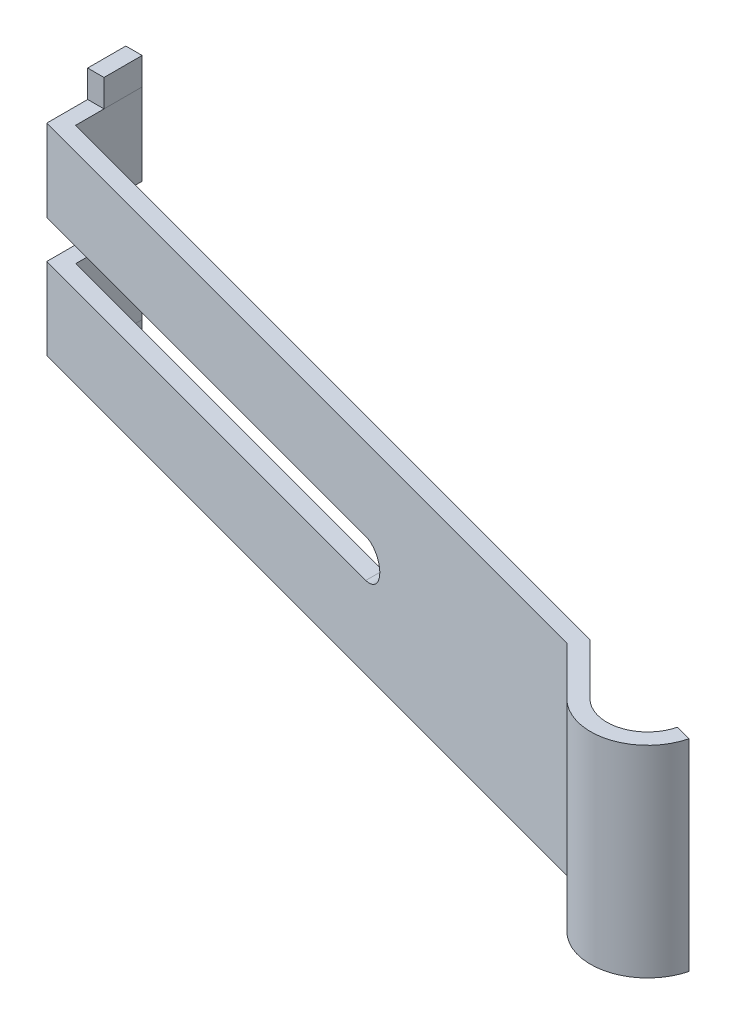
ISO-10303-21;
HEADER;
FILE_DESCRIPTION(('STEP AP214'),'2;1');
FILE_NAME('part.step','',(''),(''),'','','');
FILE_SCHEMA(('AUTOMOTIVE_DESIGN { 1 0 10303 214 1 1 1 1 }'));
ENDSEC;
DATA;
#1=APPLICATION_CONTEXT('core data for automotive mechanical design processes');
#2=APPLICATION_PROTOCOL_DEFINITION('international standard','automotive_design',2000,#1);
#3=PRODUCT_CONTEXT('',#1,'mechanical');
#4=PRODUCT('Part','Part','',(#3));
#5=PRODUCT_RELATED_PRODUCT_CATEGORY('part','',(#4));
#6=PRODUCT_DEFINITION_FORMATION('','',#4);
#7=PRODUCT_DEFINITION_CONTEXT('part definition',#1,'design');
#8=PRODUCT_DEFINITION('design','',#6,#7);
#9=PRODUCT_DEFINITION_SHAPE('','',#8);
#10=(LENGTH_UNIT() NAMED_UNIT(*) SI_UNIT(.MILLI.,.METRE.));
#11=(NAMED_UNIT(*) PLANE_ANGLE_UNIT() SI_UNIT($,.RADIAN.));
#12=(NAMED_UNIT(*) SI_UNIT($,.STERADIAN.) SOLID_ANGLE_UNIT());
#13=UNCERTAINTY_MEASURE_WITH_UNIT(LENGTH_MEASURE(1.E-05),#10,'distance_accuracy_value','');
#14=(GEOMETRIC_REPRESENTATION_CONTEXT(3) GLOBAL_UNCERTAINTY_ASSIGNED_CONTEXT((#13)) GLOBAL_UNIT_ASSIGNED_CONTEXT((#10,
#11,#12)) REPRESENTATION_CONTEXT('',''));
#15=CARTESIAN_POINT('',(0.,0.,0.));
#16=DIRECTION('',(0.,0.,1.));
#17=DIRECTION('',(1.,0.,0.));
#18=AXIS2_PLACEMENT_3D('',#15,#16,#17);
#19=CARTESIAN_POINT('',(-5.,-1.85,3.85));
#20=DIRECTION('',(0.,0.,-1.));
#21=DIRECTION('',(0.,-1.,0.));
#22=AXIS2_PLACEMENT_3D('',#19,#20,#21);
#23=PLANE('',#22);
#24=DIRECTION('',(0.,-1.,0.));
#25=VECTOR('',#24,1.);
#26=CARTESIAN_POINT('',(-5.,-1.85,3.85));
#27=LINE('',#26,#25);
#28=CARTESIAN_POINT('',(-5.,-1.85,3.85));
#29=VERTEX_POINT('',#28);
#30=CARTESIAN_POINT('',(-5.,-2.35,3.85));
#31=VERTEX_POINT('',#30);
#32=EDGE_CURVE('E234',#29,#31,#27,.T.);
#33=ORIENTED_EDGE('',*,*,#32,.T.);
#34=DIRECTION('',(-1.,0.,0.));
#35=VECTOR('',#34,1.);
#36=CARTESIAN_POINT('',(-5.,-2.35,3.85));
#37=LINE('',#36,#35);
#38=CARTESIAN_POINT('',(-5.3,-2.35,3.85));
#39=VERTEX_POINT('',#38);
#40=EDGE_CURVE('E11',#31,#39,#37,.T.);
#41=ORIENTED_EDGE('',*,*,#40,.T.);
#42=DIRECTION('',(0.,-1.,0.));
#43=VECTOR('',#42,1.);
#44=CARTESIAN_POINT('',(-5.3,-1.85,3.85));
#45=LINE('',#44,#43);
#46=CARTESIAN_POINT('',(-5.3,-1.85,3.85));
#47=VERTEX_POINT('',#46);
#48=EDGE_CURVE('E378',#47,#39,#45,.T.);
#49=ORIENTED_EDGE('',*,*,#48,.F.);
#50=DIRECTION('',(1.,0.,0.));
#51=VECTOR('',#50,1.);
#52=CARTESIAN_POINT('',(-5.3,-1.85,3.85));
#53=LINE('',#52,#51);
#54=EDGE_CURVE('E433',#47,#29,#53,.T.);
#55=ORIENTED_EDGE('',*,*,#54,.T.);
#56=EDGE_LOOP('',(#33,#41,#49,#55));
#57=FACE_BOUND('',#56,.T.);
#58=ADVANCED_FACE('F16',(#57),#23,.T.);
#59=CARTESIAN_POINT('',(-5.,1.85,3.85));
#60=DIRECTION('',(0.,0.,1.));
#61=DIRECTION('',(0.,-1.,0.));
#62=AXIS2_PLACEMENT_3D('',#59,#60,#61);
#63=PLANE('',#62);
#64=DIRECTION('',(1.,0.,0.));
#65=VECTOR('',#64,1.);
#66=CARTESIAN_POINT('',(-5.3,1.85,3.85));
#67=LINE('',#66,#65);
#68=CARTESIAN_POINT('',(-5.3,1.85,3.85));
#69=VERTEX_POINT('',#68);
#70=CARTESIAN_POINT('',(-5.,1.85,3.85));
#71=VERTEX_POINT('',#70);
#72=EDGE_CURVE('E345',#69,#71,#67,.T.);
#73=ORIENTED_EDGE('',*,*,#72,.F.);
#74=DIRECTION('',(0.,1.,0.));
#75=VECTOR('',#74,1.);
#76=CARTESIAN_POINT('',(-5.3,1.85,3.85));
#77=LINE('',#76,#75);
#78=CARTESIAN_POINT('',(-5.3,2.35,3.85));
#79=VERTEX_POINT('',#78);
#80=EDGE_CURVE('E299',#69,#79,#77,.T.);
#81=ORIENTED_EDGE('',*,*,#80,.T.);
#82=DIRECTION('',(-1.,0.,0.));
#83=VECTOR('',#82,1.);
#84=CARTESIAN_POINT('',(-5.,2.35,3.85));
#85=LINE('',#84,#83);
#86=CARTESIAN_POINT('',(-5.,2.35,3.85));
#87=VERTEX_POINT('',#86);
#88=EDGE_CURVE('E295',#87,#79,#85,.T.);
#89=ORIENTED_EDGE('',*,*,#88,.F.);
#90=DIRECTION('',(0.,1.,0.));
#91=VECTOR('',#90,1.);
#92=CARTESIAN_POINT('',(-5.,1.85,3.85));
#93=LINE('',#92,#91);
#94=EDGE_CURVE('E412',#71,#87,#93,.T.);
#95=ORIENTED_EDGE('',*,*,#94,.F.);
#96=EDGE_LOOP('',(#73,#81,#89,#95));
#97=FACE_BOUND('',#96,.T.);
#98=ADVANCED_FACE('F548',(#97),#63,.F.);
#99=CARTESIAN_POINT('',(-5.15,-2.35,4.2));
#100=DIRECTION('',(0.,1.,0.));
#101=DIRECTION('',(0.,0.,-1.));
#102=AXIS2_PLACEMENT_3D('',#99,#100,#101);
#103=PLANE('',#102);
#104=DIRECTION('',(0.,0.,-1.));
#105=VECTOR('',#104,1.);
#106=CARTESIAN_POINT('',(-5.,-2.35,4.55));
#107=LINE('',#106,#105);
#108=CARTESIAN_POINT('',(-5.,-2.35,4.55));
#109=VERTEX_POINT('',#108);
#110=EDGE_CURVE('E298',#109,#31,#107,.T.);
#111=ORIENTED_EDGE('',*,*,#110,.F.);
#112=DIRECTION('',(1.,0.,0.));
#113=VECTOR('',#112,1.);
#114=CARTESIAN_POINT('',(-5.3,-2.35,4.55));
#115=LINE('',#114,#113);
#116=CARTESIAN_POINT('',(-5.3,-2.35,4.55));
#117=VERTEX_POINT('',#116);
#118=EDGE_CURVE('E223',#117,#109,#115,.T.);
#119=ORIENTED_EDGE('',*,*,#118,.F.);
#120=DIRECTION('',(0.,0.,1.));
#121=VECTOR('',#120,1.);
#122=CARTESIAN_POINT('',(-5.3,-2.35,3.85));
#123=LINE('',#122,#121);
#124=EDGE_CURVE('E27',#39,#117,#123,.T.);
#125=ORIENTED_EDGE('',*,*,#124,.F.);
#126=ORIENTED_EDGE('',*,*,#40,.F.);
#127=EDGE_LOOP('',(#111,#119,#125,#126));
#128=FACE_BOUND('',#127,.T.);
#129=ADVANCED_FACE('F553',(#128),#103,.F.);
#130=CARTESIAN_POINT('',(-5.3,-1.85,3.85));
#131=DIRECTION('',(-1.,0.,0.));
#132=DIRECTION('',(0.,0.,1.));
#133=AXIS2_PLACEMENT_3D('',#130,#131,#132);
#134=PLANE('',#133);
#135=ORIENTED_EDGE('',*,*,#48,.T.);
#136=ORIENTED_EDGE('',*,*,#124,.T.);
#137=DIRECTION('',(0.,-1.,0.));
#138=VECTOR('',#137,1.);
#139=CARTESIAN_POINT('',(-5.3,-1.85,4.55));
#140=LINE('',#139,#138);
#141=CARTESIAN_POINT('',(-5.3,-1.85,4.55));
#142=VERTEX_POINT('',#141);
#143=EDGE_CURVE('E291',#142,#117,#140,.T.);
#144=ORIENTED_EDGE('',*,*,#143,.F.);
#145=DIRECTION('',(0.,0.,-1.));
#146=VECTOR('',#145,1.);
#147=CARTESIAN_POINT('',(-5.3,-1.85,5.3));
#148=LINE('',#147,#146);
#149=EDGE_CURVE('E206',#142,#47,#148,.T.);
#150=ORIENTED_EDGE('',*,*,#149,.T.);
#151=EDGE_LOOP('',(#135,#136,#144,#150));
#152=FACE_BOUND('',#151,.T.);
#153=ADVANCED_FACE('F580',(#152),#134,.T.);
#154=CARTESIAN_POINT('',(-5.3,1.85,3.85));
#155=DIRECTION('',(0.,0.,1.));
#156=DIRECTION('',(0.,-1.,0.));
#157=AXIS2_PLACEMENT_3D('',#154,#155,#156);
#158=PLANE('',#157);
#159=DIRECTION('',(0.,-1.,0.));
#160=VECTOR('',#159,1.);
#161=CARTESIAN_POINT('',(-5.,1.85,3.85));
#162=LINE('',#161,#160);
#163=CARTESIAN_POINT('',(-5.,-0.35,3.85));
#164=VERTEX_POINT('',#163);
#165=EDGE_CURVE('E239',#164,#29,#162,.T.);
#166=ORIENTED_EDGE('',*,*,#165,.T.);
#167=ORIENTED_EDGE('',*,*,#54,.F.);
#168=DIRECTION('',(0.,-1.,0.));
#169=VECTOR('',#168,1.);
#170=CARTESIAN_POINT('',(-5.3,1.85,3.85));
#171=LINE('',#170,#169);
#172=CARTESIAN_POINT('',(-5.3,-0.35,3.85));
#173=VERTEX_POINT('',#172);
#174=EDGE_CURVE('E227',#173,#47,#171,.T.);
#175=ORIENTED_EDGE('',*,*,#174,.F.);
#176=DIRECTION('',(-1.,0.,0.));
#177=VECTOR('',#176,1.);
#178=CARTESIAN_POINT('',(2.7,-0.35,3.85));
#179=LINE('',#178,#177);
#180=EDGE_CURVE('E390',#164,#173,#179,.T.);
#181=ORIENTED_EDGE('',*,*,#180,.F.);
#182=EDGE_LOOP('',(#166,#167,#175,#181));
#183=FACE_BOUND('',#182,.T.);
#184=ADVANCED_FACE('F504',(#183),#158,.F.);
#185=CARTESIAN_POINT('',(-5.,-1.85,4.55));
#186=DIRECTION('',(1.,0.,0.));
#187=DIRECTION('',(0.,1.,0.));
#188=AXIS2_PLACEMENT_3D('',#185,#186,#187);
#189=PLANE('',#188);
#190=DIRECTION('',(0.,-1.,0.));
#191=VECTOR('',#190,1.);
#192=CARTESIAN_POINT('',(-5.,-1.85,4.55));
#193=LINE('',#192,#191);
#194=CARTESIAN_POINT('',(-5.,-1.85,4.55));
#195=VERTEX_POINT('',#194);
#196=EDGE_CURVE('E215',#195,#109,#193,.T.);
#197=ORIENTED_EDGE('',*,*,#196,.T.);
#198=ORIENTED_EDGE('',*,*,#110,.T.);
#199=ORIENTED_EDGE('',*,*,#32,.F.);
#200=DIRECTION('',(0.,0.,1.));
#201=VECTOR('',#200,1.);
#202=CARTESIAN_POINT('',(-5.,-1.85,3.85));
#203=LINE('',#202,#201);
#204=EDGE_CURVE('E231',#29,#195,#203,.T.);
#205=ORIENTED_EDGE('',*,*,#204,.T.);
#206=EDGE_LOOP('',(#197,#198,#199,#205));
#207=FACE_BOUND('',#206,.T.);
#208=ADVANCED_FACE('F233',(#207),#189,.T.);
#209=CARTESIAN_POINT('',(-5.15,2.35,4.2));
#210=DIRECTION('',(0.,1.,0.));
#211=DIRECTION('',(0.,0.,-1.));
#212=AXIS2_PLACEMENT_3D('',#209,#210,#211);
#213=PLANE('',#212);
#214=ORIENTED_EDGE('',*,*,#88,.T.);
#215=DIRECTION('',(0.,0.,1.));
#216=VECTOR('',#215,1.);
#217=CARTESIAN_POINT('',(-5.3,2.35,3.85));
#218=LINE('',#217,#216);
#219=CARTESIAN_POINT('',(-5.3,2.35,4.55));
#220=VERTEX_POINT('',#219);
#221=EDGE_CURVE('E449',#79,#220,#218,.T.);
#222=ORIENTED_EDGE('',*,*,#221,.T.);
#223=DIRECTION('',(1.,0.,0.));
#224=VECTOR('',#223,1.);
#225=CARTESIAN_POINT('',(-5.3,2.35,4.55));
#226=LINE('',#225,#224);
#227=CARTESIAN_POINT('',(-5.,2.35,4.55));
#228=VERTEX_POINT('',#227);
#229=EDGE_CURVE('E311',#220,#228,#226,.T.);
#230=ORIENTED_EDGE('',*,*,#229,.T.);
#231=DIRECTION('',(0.,0.,-1.));
#232=VECTOR('',#231,1.);
#233=CARTESIAN_POINT('',(-5.,2.35,4.55));
#234=LINE('',#233,#232);
#235=EDGE_CURVE('E20',#228,#87,#234,.T.);
#236=ORIENTED_EDGE('',*,*,#235,.T.);
#237=EDGE_LOOP('',(#214,#222,#230,#236));
#238=FACE_BOUND('',#237,.T.);
#239=ADVANCED_FACE('F568',(#238),#213,.T.);
#240=CARTESIAN_POINT('',(-5.3,1.85,3.85));
#241=DIRECTION('',(1.,0.,0.));
#242=DIRECTION('',(0.,1.,0.));
#243=AXIS2_PLACEMENT_3D('',#240,#241,#242);
#244=PLANE('',#243);
#245=DIRECTION('',(0.,0.,-1.));
#246=VECTOR('',#245,1.);
#247=CARTESIAN_POINT('',(-5.3,1.85,5.3));
#248=LINE('',#247,#246);
#249=CARTESIAN_POINT('',(-5.3,1.85,4.55));
#250=VERTEX_POINT('',#249);
#251=EDGE_CURVE('E300',#250,#69,#248,.T.);
#252=ORIENTED_EDGE('',*,*,#251,.F.);
#253=DIRECTION('',(0.,1.,0.));
#254=VECTOR('',#253,1.);
#255=CARTESIAN_POINT('',(-5.3,1.85,4.55));
#256=LINE('',#255,#254);
#257=EDGE_CURVE('E305',#250,#220,#256,.T.);
#258=ORIENTED_EDGE('',*,*,#257,.T.);
#259=ORIENTED_EDGE('',*,*,#221,.F.);
#260=ORIENTED_EDGE('',*,*,#80,.F.);
#261=EDGE_LOOP('',(#252,#258,#259,#260));
#262=FACE_BOUND('',#261,.T.);
#263=ADVANCED_FACE('F565',(#262),#244,.F.);
#264=CARTESIAN_POINT('',(-5.3,1.85,3.85));
#265=DIRECTION('',(0.,0.,1.));
#266=DIRECTION('',(0.,-1.,0.));
#267=AXIS2_PLACEMENT_3D('',#264,#265,#266);
#268=PLANE('',#267);
#269=DIRECTION('',(0.,-1.,0.));
#270=VECTOR('',#269,1.);
#271=CARTESIAN_POINT('',(-5.,1.85,3.85));
#272=LINE('',#271,#270);
#273=CARTESIAN_POINT('',(-5.,0.35,3.85));
#274=VERTEX_POINT('',#273);
#275=EDGE_CURVE('E331',#71,#274,#272,.T.);
#276=ORIENTED_EDGE('',*,*,#275,.T.);
#277=DIRECTION('',(1.,0.,0.));
#278=VECTOR('',#277,1.);
#279=CARTESIAN_POINT('',(-5.3,0.35,3.85));
#280=LINE('',#279,#278);
#281=CARTESIAN_POINT('',(-5.3,0.35,3.85));
#282=VERTEX_POINT('',#281);
#283=EDGE_CURVE('E409',#282,#274,#280,.T.);
#284=ORIENTED_EDGE('',*,*,#283,.F.);
#285=DIRECTION('',(0.,-1.,0.));
#286=VECTOR('',#285,1.);
#287=CARTESIAN_POINT('',(-5.3,1.85,3.85));
#288=LINE('',#287,#286);
#289=EDGE_CURVE('E304',#69,#282,#288,.T.);
#290=ORIENTED_EDGE('',*,*,#289,.F.);
#291=ORIENTED_EDGE('',*,*,#72,.T.);
#292=EDGE_LOOP('',(#276,#284,#290,#291));
#293=FACE_BOUND('',#292,.T.);
#294=ADVANCED_FACE('F562',(#293),#268,.F.);
#295=CARTESIAN_POINT('',(-5.,1.85,4.55));
#296=DIRECTION('',(-1.,0.,0.));
#297=DIRECTION('',(0.,0.,1.));
#298=AXIS2_PLACEMENT_3D('',#295,#296,#297);
#299=PLANE('',#298);
#300=DIRECTION('',(0.,0.,1.));
#301=VECTOR('',#300,1.);
#302=CARTESIAN_POINT('',(-5.,1.85,3.85));
#303=LINE('',#302,#301);
#304=CARTESIAN_POINT('',(-5.,1.85,4.55));
#305=VERTEX_POINT('',#304);
#306=EDGE_CURVE('E324',#71,#305,#303,.T.);
#307=ORIENTED_EDGE('',*,*,#306,.F.);
#308=ORIENTED_EDGE('',*,*,#94,.T.);
#309=ORIENTED_EDGE('',*,*,#235,.F.);
#310=DIRECTION('',(0.,1.,0.));
#311=VECTOR('',#310,1.);
#312=CARTESIAN_POINT('',(-5.,1.85,4.55));
#313=LINE('',#312,#311);
#314=EDGE_CURVE('E266',#305,#228,#313,.T.);
#315=ORIENTED_EDGE('',*,*,#314,.F.);
#316=EDGE_LOOP('',(#307,#308,#309,#315));
#317=FACE_BOUND('',#316,.T.);
#318=ADVANCED_FACE('F559',(#317),#299,.F.);
#319=CARTESIAN_POINT('',(-5.3,0.35,3.85));
#320=DIRECTION('',(0.,1.,0.));
#321=DIRECTION('',(0.,0.,-1.));
#322=AXIS2_PLACEMENT_3D('',#319,#320,#321);
#323=PLANE('',#322);
#324=DIRECTION('',(0.,0.,-1.));
#325=VECTOR('',#324,1.);
#326=CARTESIAN_POINT('',(-5.,0.35,3.85));
#327=LINE('',#326,#325);
#328=CARTESIAN_POINT('',(-5.,0.35,5.069801903606));
#329=VERTEX_POINT('',#328);
#330=EDGE_CURVE('E341',#329,#274,#327,.T.);
#331=ORIENTED_EDGE('',*,*,#330,.F.);
#332=DIRECTION('',(-0.965925826288944,0.,-0.258819045102985));
#333=VECTOR('',#332,1.);
#334=CARTESIAN_POINT('',(-5.292427143235,0.35,4.991446286732));
#335=LINE('',#334,#333);
#336=CARTESIAN_POINT('',(2.7,0.35,7.133010685326));
#337=VERTEX_POINT('',#336);
#338=EDGE_CURVE('E364',#337,#329,#335,.T.);
#339=ORIENTED_EDGE('',*,*,#338,.F.);
#340=DIRECTION('',(0.,0.,1.));
#341=VECTOR('',#340,1.);
#342=CARTESIAN_POINT('',(2.7,0.35,3.85));
#343=LINE('',#342,#341);
#344=CARTESIAN_POINT('',(2.7,0.35,7.443593539449));
#345=VERTEX_POINT('',#344);
#346=EDGE_CURVE('E389',#337,#345,#343,.T.);
#347=ORIENTED_EDGE('',*,*,#346,.T.);
#348=DIRECTION('',(-0.965925826288944,0.,-0.258819045102985));
#349=VECTOR('',#348,1.);
#350=CARTESIAN_POINT('',(-5.48125,0.35,5.251434208872));
#351=LINE('',#350,#349);
#352=CARTESIAN_POINT('',(-5.3,0.35,5.3));
#353=VERTEX_POINT('',#352);
#354=EDGE_CURVE('E272',#345,#353,#351,.T.);
#355=ORIENTED_EDGE('',*,*,#354,.T.);
#356=DIRECTION('',(0.,0.,1.));
#357=VECTOR('',#356,1.);
#358=CARTESIAN_POINT('',(-5.3,0.35,3.85));
#359=LINE('',#358,#357);
#360=EDGE_CURVE('E273',#282,#353,#359,.T.);
#361=ORIENTED_EDGE('',*,*,#360,.F.);
#362=ORIENTED_EDGE('',*,*,#283,.T.);
#363=EDGE_LOOP('',(#331,#339,#347,#355,#361,#362));
#364=FACE_BOUND('',#363,.T.);
#365=ADVANCED_FACE('F561',(#364),#323,.F.);
#366=CARTESIAN_POINT('',(2.7,0.,3.85));
#367=DIRECTION('',(0.,0.,-1.));
#368=DIRECTION('',(1.,0.,0.));
#369=AXIS2_PLACEMENT_3D('',#366,#367,#368);
#370=CYLINDRICAL_SURFACE('',#369,0.35);
#371=DIRECTION('',(0.,0.,1.));
#372=VECTOR('',#371,1.);
#373=CARTESIAN_POINT('',(2.7,-0.35,3.85));
#374=LINE('',#373,#372);
#375=CARTESIAN_POINT('',(2.7,-0.35,7.133010685326));
#376=VERTEX_POINT('',#375);
#377=CARTESIAN_POINT('',(2.7,-0.35,7.443593539449));
#378=VERTEX_POINT('',#377);
#379=EDGE_CURVE('E386',#376,#378,#374,.T.);
#380=ORIENTED_EDGE('',*,*,#379,.T.);
#381=CARTESIAN_POINT('',(2.7,0.,7.443593539449));
#382=DIRECTION('',(-0.258819045102985,0.,0.965925826288944));
#383=DIRECTION('',(-0.965925826288944,0.,-0.258819045102985));
#384=AXIS2_PLACEMENT_3D('',#381,#382,#383);
#385=ELLIPSE('',#384,0.362346663144,0.35);
#386=EDGE_CURVE('E294',#378,#345,#385,.T.);
#387=ORIENTED_EDGE('',*,*,#386,.T.);
#388=ORIENTED_EDGE('',*,*,#346,.F.);
#389=CARTESIAN_POINT('',(2.7,0.,7.133010685326));
#390=DIRECTION('',(-0.258819045102985,0.,0.965925826288944));
#391=DIRECTION('',(-0.965925826288944,0.,-0.258819045102985));
#392=AXIS2_PLACEMENT_3D('',#389,#390,#391);
#393=ELLIPSE('',#392,0.362346663144,0.35);
#394=EDGE_CURVE('E369',#376,#337,#393,.T.);
#395=ORIENTED_EDGE('',*,*,#394,.F.);
#396=EDGE_LOOP('',(#380,#387,#388,#395));
#397=FACE_BOUND('',#396,.T.);
#398=ADVANCED_FACE('F544',(#397),#370,.F.);
#399=CARTESIAN_POINT('',(2.7,-0.35,3.85));
#400=DIRECTION('',(0.,-1.,0.));
#401=DIRECTION('',(-1.,0.,0.));
#402=AXIS2_PLACEMENT_3D('',#399,#400,#401);
#403=PLANE('',#402);
#404=DIRECTION('',(0.,0.,1.));
#405=VECTOR('',#404,1.);
#406=CARTESIAN_POINT('',(-5.,-0.35,3.85));
#407=LINE('',#406,#405);
#408=CARTESIAN_POINT('',(-5.,-0.35,5.069801903606));
#409=VERTEX_POINT('',#408);
#410=EDGE_CURVE('E479',#164,#409,#407,.T.);
#411=ORIENTED_EDGE('',*,*,#410,.F.);
#412=ORIENTED_EDGE('',*,*,#180,.T.);
#413=DIRECTION('',(0.,0.,1.));
#414=VECTOR('',#413,1.);
#415=CARTESIAN_POINT('',(-5.3,-0.35,3.85));
#416=LINE('',#415,#414);
#417=CARTESIAN_POINT('',(-5.3,-0.35,5.3));
#418=VERTEX_POINT('',#417);
#419=EDGE_CURVE('E437',#173,#418,#416,.T.);
#420=ORIENTED_EDGE('',*,*,#419,.T.);
#421=DIRECTION('',(0.965925826288944,0.,0.258819045102985));
#422=VECTOR('',#421,1.);
#423=CARTESIAN_POINT('',(-1.749199192431,-0.35,6.251434208872));
#424=LINE('',#423,#422);
#425=EDGE_CURVE('E308',#418,#378,#424,.T.);
#426=ORIENTED_EDGE('',*,*,#425,.T.);
#427=ORIENTED_EDGE('',*,*,#379,.F.);
#428=DIRECTION('',(0.965925826288944,0.,0.258819045102985));
#429=VECTOR('',#428,1.);
#430=CARTESIAN_POINT('',(-1.560376335666,-0.35,5.991446286732));
#431=LINE('',#430,#429);
#432=EDGE_CURVE('E287',#409,#376,#431,.T.);
#433=ORIENTED_EDGE('',*,*,#432,.F.);
#434=EDGE_LOOP('',(#411,#412,#420,#426,#427,#433));
#435=FACE_BOUND('',#434,.T.);
#436=ADVANCED_FACE('F509',(#435),#403,.F.);
#437=CARTESIAN_POINT('',(-5.3,1.85,5.3));
#438=DIRECTION('',(1.,0.,0.));
#439=DIRECTION('',(0.,1.,0.));
#440=AXIS2_PLACEMENT_3D('',#437,#438,#439);
#441=PLANE('',#440);
#442=ORIENTED_EDGE('',*,*,#174,.T.);
#443=ORIENTED_EDGE('',*,*,#149,.F.);
#444=DIRECTION('',(0.,0.,-1.));
#445=VECTOR('',#444,1.);
#446=CARTESIAN_POINT('',(-5.3,-1.85,5.3));
#447=LINE('',#446,#445);
#448=CARTESIAN_POINT('',(-5.3,-1.85,5.3));
#449=VERTEX_POINT('',#448);
#450=EDGE_CURVE('E255',#449,#142,#447,.T.);
#451=ORIENTED_EDGE('',*,*,#450,.F.);
#452=DIRECTION('',(0.,-1.,0.));
#453=VECTOR('',#452,1.);
#454=CARTESIAN_POINT('',(-5.3,1.85,5.3));
#455=LINE('',#454,#453);
#456=EDGE_CURVE('E240',#418,#449,#455,.T.);
#457=ORIENTED_EDGE('',*,*,#456,.F.);
#458=ORIENTED_EDGE('',*,*,#419,.F.);
#459=EDGE_LOOP('',(#442,#443,#451,#457,#458));
#460=FACE_BOUND('',#459,.T.);
#461=ADVANCED_FACE('F536',(#460),#441,.F.);
#462=CARTESIAN_POINT('',(-5.3,-1.85,4.55));
#463=DIRECTION('',(0.,0.,1.));
#464=DIRECTION('',(0.,-1.,0.));
#465=AXIS2_PLACEMENT_3D('',#462,#463,#464);
#466=PLANE('',#465);
#467=ORIENTED_EDGE('',*,*,#143,.T.);
#468=ORIENTED_EDGE('',*,*,#118,.T.);
#469=ORIENTED_EDGE('',*,*,#196,.F.);
#470=DIRECTION('',(1.,0.,0.));
#471=VECTOR('',#470,1.);
#472=CARTESIAN_POINT('',(-5.3,-1.85,4.55));
#473=LINE('',#472,#471);
#474=EDGE_CURVE('E220',#142,#195,#473,.T.);
#475=ORIENTED_EDGE('',*,*,#474,.F.);
#476=EDGE_LOOP('',(#467,#468,#469,#475));
#477=FACE_BOUND('',#476,.T.);
#478=ADVANCED_FACE('F218',(#477),#466,.T.);
#479=CARTESIAN_POINT('',(-5.,1.85,3.85));
#480=DIRECTION('',(-1.,0.,0.));
#481=DIRECTION('',(0.,0.,1.));
#482=AXIS2_PLACEMENT_3D('',#479,#480,#481);
#483=PLANE('',#482);
#484=DIRECTION('',(0.,-1.,0.));
#485=VECTOR('',#484,1.);
#486=CARTESIAN_POINT('',(-5.,1.85,5.069801903606));
#487=LINE('',#486,#485);
#488=CARTESIAN_POINT('',(-5.,-1.85,5.069801903606));
#489=VERTEX_POINT('',#488);
#490=EDGE_CURVE('E246',#409,#489,#487,.T.);
#491=ORIENTED_EDGE('',*,*,#490,.T.);
#492=DIRECTION('',(0.,0.,1.));
#493=VECTOR('',#492,1.);
#494=CARTESIAN_POINT('',(-5.,-1.85,3.85));
#495=LINE('',#494,#493);
#496=EDGE_CURVE('E243',#195,#489,#495,.T.);
#497=ORIENTED_EDGE('',*,*,#496,.F.);
#498=ORIENTED_EDGE('',*,*,#204,.F.);
#499=ORIENTED_EDGE('',*,*,#165,.F.);
#500=ORIENTED_EDGE('',*,*,#410,.T.);
#501=EDGE_LOOP('',(#491,#497,#498,#499,#500));
#502=FACE_BOUND('',#501,.T.);
#503=ADVANCED_FACE('F244',(#502),#483,.F.);
#504=CARTESIAN_POINT('',(-5.3,1.85,5.3));
#505=DIRECTION('',(-0.258819045102985,0.,0.965925826288944));
#506=DIRECTION('',(0.,1.,0.));
#507=AXIS2_PLACEMENT_3D('',#504,#505,#506);
#508=PLANE('',#507);
#509=DIRECTION('',(0.965925826288944,0.,0.258819045102985));
#510=VECTOR('',#509,1.);
#511=CARTESIAN_POINT('',(-5.3,1.85,5.3));
#512=LINE('',#511,#510);
#513=CARTESIAN_POINT('',(-5.3,1.85,5.3));
#514=VERTEX_POINT('',#513);
#515=CARTESIAN_POINT('',(7.739998654902,1.85,8.794057108884));
#516=VERTEX_POINT('',#515);
#517=EDGE_CURVE('E283',#514,#516,#512,.T.);
#518=ORIENTED_EDGE('',*,*,#517,.F.);
#519=DIRECTION('',(0.,-1.,0.));
#520=VECTOR('',#519,1.);
#521=CARTESIAN_POINT('',(-5.3,1.85,5.3));
#522=LINE('',#521,#520);
#523=EDGE_CURVE('E268',#514,#353,#522,.T.);
#524=ORIENTED_EDGE('',*,*,#523,.T.);
#525=ORIENTED_EDGE('',*,*,#354,.F.);
#526=ORIENTED_EDGE('',*,*,#386,.F.);
#527=ORIENTED_EDGE('',*,*,#425,.F.);
#528=ORIENTED_EDGE('',*,*,#456,.T.);
#529=DIRECTION('',(0.965925826288944,0.,0.258819045102985));
#530=VECTOR('',#529,1.);
#531=CARTESIAN_POINT('',(-5.3,-1.85,5.3));
#532=LINE('',#531,#530);
#533=CARTESIAN_POINT('',(7.739998654902,-1.85,8.794057108884));
#534=VERTEX_POINT('',#533);
#535=EDGE_CURVE('E262',#449,#534,#532,.T.);
#536=ORIENTED_EDGE('',*,*,#535,.T.);
#537=DIRECTION('',(0.,-1.,0.));
#538=VECTOR('',#537,1.);
#539=CARTESIAN_POINT('',(7.739998654902,1.85,8.794057108884));
#540=LINE('',#539,#538);
#541=EDGE_CURVE('E288',#516,#534,#540,.T.);
#542=ORIENTED_EDGE('',*,*,#541,.F.);
#543=EDGE_LOOP('',(#518,#524,#525,#526,#527,#528,#536,#542));
#544=FACE_BOUND('',#543,.T.);
#545=ADVANCED_FACE('F531',(#544),#508,.T.);
#546=CARTESIAN_POINT('',(-5.3,1.85,5.3));
#547=DIRECTION('',(1.,0.,0.));
#548=DIRECTION('',(0.,1.,0.));
#549=AXIS2_PLACEMENT_3D('',#546,#547,#548);
#550=PLANE('',#549);
#551=ORIENTED_EDGE('',*,*,#251,.T.);
#552=ORIENTED_EDGE('',*,*,#289,.T.);
#553=ORIENTED_EDGE('',*,*,#360,.T.);
#554=ORIENTED_EDGE('',*,*,#523,.F.);
#555=DIRECTION('',(0.,0.,-1.));
#556=VECTOR('',#555,1.);
#557=CARTESIAN_POINT('',(-5.3,1.85,5.3));
#558=LINE('',#557,#556);
#559=EDGE_CURVE('E279',#514,#250,#558,.T.);
#560=ORIENTED_EDGE('',*,*,#559,.T.);
#561=EDGE_LOOP('',(#551,#552,#553,#554,#560));
#562=FACE_BOUND('',#561,.T.);
#563=ADVANCED_FACE('F601',(#562),#550,.F.);
#564=CARTESIAN_POINT('',(-5.3,1.85,4.55));
#565=DIRECTION('',(0.,0.,-1.));
#566=DIRECTION('',(0.,-1.,0.));
#567=AXIS2_PLACEMENT_3D('',#564,#565,#566);
#568=PLANE('',#567);
#569=DIRECTION('',(1.,0.,0.));
#570=VECTOR('',#569,1.);
#571=CARTESIAN_POINT('',(-5.3,1.85,4.55));
#572=LINE('',#571,#570);
#573=EDGE_CURVE('E284',#250,#305,#572,.T.);
#574=ORIENTED_EDGE('',*,*,#573,.T.);
#575=ORIENTED_EDGE('',*,*,#314,.T.);
#576=ORIENTED_EDGE('',*,*,#229,.F.);
#577=ORIENTED_EDGE('',*,*,#257,.F.);
#578=EDGE_LOOP('',(#574,#575,#576,#577));
#579=FACE_BOUND('',#578,.T.);
#580=ADVANCED_FACE('F594',(#579),#568,.F.);
#581=CARTESIAN_POINT('',(-5.,1.85,3.85));
#582=DIRECTION('',(-1.,0.,0.));
#583=DIRECTION('',(0.,0.,1.));
#584=AXIS2_PLACEMENT_3D('',#581,#582,#583);
#585=PLANE('',#584);
#586=DIRECTION('',(0.,0.,1.));
#587=VECTOR('',#586,1.);
#588=CARTESIAN_POINT('',(-5.,1.85,3.85));
#589=LINE('',#588,#587);
#590=CARTESIAN_POINT('',(-5.,1.85,5.069801903606));
#591=VERTEX_POINT('',#590);
#592=EDGE_CURVE('E401',#305,#591,#589,.T.);
#593=ORIENTED_EDGE('',*,*,#592,.T.);
#594=DIRECTION('',(0.,-1.,0.));
#595=VECTOR('',#594,1.);
#596=CARTESIAN_POINT('',(-5.,1.85,5.069801903606));
#597=LINE('',#596,#595);
#598=EDGE_CURVE('E368',#591,#329,#597,.T.);
#599=ORIENTED_EDGE('',*,*,#598,.T.);
#600=ORIENTED_EDGE('',*,*,#330,.T.);
#601=ORIENTED_EDGE('',*,*,#275,.F.);
#602=ORIENTED_EDGE('',*,*,#306,.T.);
#603=EDGE_LOOP('',(#593,#599,#600,#601,#602));
#604=FACE_BOUND('',#603,.T.);
#605=ADVANCED_FACE('F591',(#604),#585,.F.);
#606=CARTESIAN_POINT('',(-5.,1.85,5.069801903606));
#607=DIRECTION('',(-0.258819045102985,0.,0.965925826288944));
#608=DIRECTION('',(0.,1.,0.));
#609=AXIS2_PLACEMENT_3D('',#606,#607,#608);
#610=PLANE('',#609);
#611=DIRECTION('',(0.,-1.,0.));
#612=VECTOR('',#611,1.);
#613=CARTESIAN_POINT('',(7.895290081964,1.85,8.525084467234));
#614=LINE('',#613,#612);
#615=CARTESIAN_POINT('',(7.895290081964,1.85,8.525084467234));
#616=VERTEX_POINT('',#615);
#617=CARTESIAN_POINT('',(7.895290081964,-1.85,8.525084467234));
#618=VERTEX_POINT('',#617);
#619=EDGE_CURVE('E349',#616,#618,#614,.T.);
#620=ORIENTED_EDGE('',*,*,#619,.T.);
#621=DIRECTION('',(0.965925826288944,0.,0.258819045102985));
#622=VECTOR('',#621,1.);
#623=CARTESIAN_POINT('',(-5.,-1.85,5.069801903606));
#624=LINE('',#623,#622);
#625=EDGE_CURVE('E251',#489,#618,#624,.T.);
#626=ORIENTED_EDGE('',*,*,#625,.F.);
#627=ORIENTED_EDGE('',*,*,#490,.F.);
#628=ORIENTED_EDGE('',*,*,#432,.T.);
#629=ORIENTED_EDGE('',*,*,#394,.T.);
#630=ORIENTED_EDGE('',*,*,#338,.T.);
#631=ORIENTED_EDGE('',*,*,#598,.F.);
#632=DIRECTION('',(0.965925826288944,0.,0.258819045102985));
#633=VECTOR('',#632,1.);
#634=CARTESIAN_POINT('',(-5.,1.85,5.069801903606));
#635=LINE('',#634,#633);
#636=EDGE_CURVE('E397',#591,#616,#635,.T.);
#637=ORIENTED_EDGE('',*,*,#636,.T.);
#638=EDGE_LOOP('',(#620,#626,#627,#628,#629,#630,#631,#637));
#639=FACE_BOUND('',#638,.T.);
#640=ADVANCED_FACE('F512',(#639),#610,.F.);
#641=CARTESIAN_POINT('',(8.623882131386,1.85,9.677940585367));
#642=DIRECTION('',(0.707106781186548,0.,-0.707106781186548));
#643=DIRECTION('',(0.,-1.,0.));
#644=AXIS2_PLACEMENT_3D('',#641,#642,#643);
#645=PLANE('',#644);
#646=DIRECTION('',(-0.707106781186548,0.,-0.707106781186548));
#647=VECTOR('',#646,1.);
#648=CARTESIAN_POINT('',(8.623882131386,1.85,9.677940585367));
#649=LINE('',#648,#647);
#650=CARTESIAN_POINT('',(8.623882131386,1.85,9.677940585367));
#651=VERTEX_POINT('',#650);
#652=EDGE_CURVE('E278',#651,#516,#649,.T.);
#653=ORIENTED_EDGE('',*,*,#652,.T.);
#654=ORIENTED_EDGE('',*,*,#541,.T.);
#655=DIRECTION('',(-0.707106781186548,0.,-0.707106781186548));
#656=VECTOR('',#655,1.);
#657=CARTESIAN_POINT('',(8.623882131386,-1.85,9.677940585367));
#658=LINE('',#657,#656);
#659=CARTESIAN_POINT('',(8.623882131386,-1.85,9.677940585367));
#660=VERTEX_POINT('',#659);
#661=EDGE_CURVE('E274',#660,#534,#658,.T.);
#662=ORIENTED_EDGE('',*,*,#661,.F.);
#663=DIRECTION('',(0.,-1.,0.));
#664=VECTOR('',#663,1.);
#665=CARTESIAN_POINT('',(8.623882131386,1.85,9.677940585367));
#666=LINE('',#665,#664);
#667=EDGE_CURVE('E391',#651,#660,#666,.T.);
#668=ORIENTED_EDGE('',*,*,#667,.F.);
#669=EDGE_LOOP('',(#653,#654,#662,#668));
#670=FACE_BOUND('',#669,.T.);
#671=ADVANCED_FACE('F528',(#670),#645,.F.);
#672=CARTESIAN_POINT('',(8.836014165742,1.85,9.465808551011));
#673=DIRECTION('',(0.707106781186548,0.,-0.707106781186548));
#674=DIRECTION('',(0.,-1.,0.));
#675=AXIS2_PLACEMENT_3D('',#672,#673,#674);
#676=PLANE('',#675);
#677=DIRECTION('',(0.,-1.,0.));
#678=VECTOR('',#677,1.);
#679=CARTESIAN_POINT('',(8.836014165742,1.85,9.465808551011));
#680=LINE('',#679,#678);
#681=CARTESIAN_POINT('',(8.836014165742,1.85,9.465808551011));
#682=VERTEX_POINT('',#681);
#683=CARTESIAN_POINT('',(8.836014165742,-1.85,9.465808551011));
#684=VERTEX_POINT('',#683);
#685=EDGE_CURVE('E417',#682,#684,#680,.T.);
#686=ORIENTED_EDGE('',*,*,#685,.T.);
#687=DIRECTION('',(-0.707106781186548,0.,-0.707106781186548));
#688=VECTOR('',#687,1.);
#689=CARTESIAN_POINT('',(8.836014165742,-1.85,9.465808551011));
#690=LINE('',#689,#688);
#691=EDGE_CURVE('E356',#684,#618,#690,.T.);
#692=ORIENTED_EDGE('',*,*,#691,.T.);
#693=ORIENTED_EDGE('',*,*,#619,.F.);
#694=DIRECTION('',(-0.707106781186548,0.,-0.707106781186548));
#695=VECTOR('',#694,1.);
#696=CARTESIAN_POINT('',(8.836014165742,1.85,9.465808551011));
#697=LINE('',#696,#695);
#698=EDGE_CURVE('E402',#682,#616,#697,.T.);
#699=ORIENTED_EDGE('',*,*,#698,.F.);
#700=EDGE_LOOP('',(#686,#692,#693,#699));
#701=FACE_BOUND('',#700,.T.);
#702=ADVANCED_FACE('F516',(#701),#676,.T.);
#703=CARTESIAN_POINT('',(2.209998132442,-1.85,7.172817655396));
#704=DIRECTION('',(0.,-1.,0.));
#705=DIRECTION('',(-1.,0.,0.));
#706=AXIS2_PLACEMENT_3D('',#703,#704,#705);
#707=PLANE('',#706);
#708=CARTESIAN_POINT('',(9.366344251631,-1.85,8.935478465121));
#709=DIRECTION('',(0.,-1.,0.));
#710=DIRECTION('',(1.,0.,0.));
#711=AXIS2_PLACEMENT_3D('',#708,#709,#710);
#712=CIRCLE('',#711,0.75);
#713=CARTESIAN_POINT('',(10.094686970869,-1.85,9.114411087451));
#714=VERTEX_POINT('',#713);
#715=EDGE_CURVE('E421',#714,#684,#712,.T.);
#716=ORIENTED_EDGE('',*,*,#715,.F.);
#717=DIRECTION('',(0.965925826288944,0.,0.258819045102985));
#718=VECTOR('',#717,1.);
#719=CARTESIAN_POINT('',(10.094686970869,-1.85,9.114411087451));
#720=LINE('',#719,#718);
#721=CARTESIAN_POINT('',(10.384509926444,-1.85,9.192068914346));
#722=VERTEX_POINT('',#721);
#723=EDGE_CURVE('E379',#714,#722,#720,.T.);
#724=ORIENTED_EDGE('',*,*,#723,.T.);
#725=CARTESIAN_POINT('',(9.366344251631,-1.85,8.935478465121));
#726=DIRECTION('',(0.,-1.,0.));
#727=DIRECTION('',(1.,0.,0.));
#728=AXIS2_PLACEMENT_3D('',#725,#726,#727);
#729=CIRCLE('',#728,1.05);
#730=EDGE_CURVE('E395',#722,#660,#729,.T.);
#731=ORIENTED_EDGE('',*,*,#730,.T.);
#732=ORIENTED_EDGE('',*,*,#661,.T.);
#733=ORIENTED_EDGE('',*,*,#535,.F.);
#734=ORIENTED_EDGE('',*,*,#450,.T.);
#735=ORIENTED_EDGE('',*,*,#474,.T.);
#736=ORIENTED_EDGE('',*,*,#496,.T.);
#737=ORIENTED_EDGE('',*,*,#625,.T.);
#738=ORIENTED_EDGE('',*,*,#691,.F.);
#739=EDGE_LOOP('',(#716,#724,#731,#732,#733,#734,#735,#736,#737,#738));
#740=FACE_BOUND('',#739,.T.);
#741=ADVANCED_FACE('F253',(#740),#707,.T.);
#742=CARTESIAN_POINT('',(2.209998132442,1.85,7.172817655396));
#743=DIRECTION('',(0.,-1.,0.));
#744=DIRECTION('',(-1.,0.,0.));
#745=AXIS2_PLACEMENT_3D('',#742,#743,#744);
#746=PLANE('',#745);
#747=ORIENTED_EDGE('',*,*,#698,.T.);
#748=ORIENTED_EDGE('',*,*,#636,.F.);
#749=ORIENTED_EDGE('',*,*,#592,.F.);
#750=ORIENTED_EDGE('',*,*,#573,.F.);
#751=ORIENTED_EDGE('',*,*,#559,.F.);
#752=ORIENTED_EDGE('',*,*,#517,.T.);
#753=ORIENTED_EDGE('',*,*,#652,.F.);
#754=CARTESIAN_POINT('',(9.366344251631,1.85,8.935478465121));
#755=DIRECTION('',(0.,-1.,0.));
#756=DIRECTION('',(1.,0.,0.));
#757=AXIS2_PLACEMENT_3D('',#754,#755,#756);
#758=CIRCLE('',#757,1.05);
#759=CARTESIAN_POINT('',(10.384509926444,1.85,9.192068914346));
#760=VERTEX_POINT('',#759);
#761=EDGE_CURVE('E396',#760,#651,#758,.T.);
#762=ORIENTED_EDGE('',*,*,#761,.F.);
#763=DIRECTION('',(0.965925826288944,0.,0.258819045102985));
#764=VECTOR('',#763,1.);
#765=CARTESIAN_POINT('',(10.094686970869,1.85,9.114411087451));
#766=LINE('',#765,#764);
#767=CARTESIAN_POINT('',(10.094686970869,1.85,9.114411087451));
#768=VERTEX_POINT('',#767);
#769=EDGE_CURVE('E350',#768,#760,#766,.T.);
#770=ORIENTED_EDGE('',*,*,#769,.F.);
#771=CARTESIAN_POINT('',(9.366344251631,1.85,8.935478465121));
#772=DIRECTION('',(0.,-1.,0.));
#773=DIRECTION('',(1.,0.,0.));
#774=AXIS2_PLACEMENT_3D('',#771,#772,#773);
#775=CIRCLE('',#774,0.75);
#776=EDGE_CURVE('E416',#768,#682,#775,.T.);
#777=ORIENTED_EDGE('',*,*,#776,.T.);
#778=EDGE_LOOP('',(#747,#748,#749,#750,#751,#752,#753,#762,#770,#777));
#779=FACE_BOUND('',#778,.T.);
#780=ADVANCED_FACE('F572',(#779),#746,.F.);
#781=CARTESIAN_POINT('',(9.366344251631,1.85,8.935478465121));
#782=DIRECTION('',(0.,1.,0.));
#783=DIRECTION('',(1.,0.,0.));
#784=AXIS2_PLACEMENT_3D('',#781,#782,#783);
#785=CYLINDRICAL_SURFACE('',#784,1.05);
#786=ORIENTED_EDGE('',*,*,#761,.T.);
#787=ORIENTED_EDGE('',*,*,#667,.T.);
#788=ORIENTED_EDGE('',*,*,#730,.F.);
#789=DIRECTION('',(0.,-1.,0.));
#790=VECTOR('',#789,1.);
#791=CARTESIAN_POINT('',(10.384509926444,1.85,9.192068914346));
#792=LINE('',#791,#790);
#793=EDGE_CURVE('E354',#760,#722,#792,.T.);
#794=ORIENTED_EDGE('',*,*,#793,.F.);
#795=EDGE_LOOP('',(#786,#787,#788,#794));
#796=FACE_BOUND('',#795,.T.);
#797=ADVANCED_FACE('F18',(#796),#785,.T.);
#798=CARTESIAN_POINT('',(9.366344251631,1.85,8.935478465121));
#799=DIRECTION('',(0.,1.,0.));
#800=DIRECTION('',(1.,0.,0.));
#801=AXIS2_PLACEMENT_3D('',#798,#799,#800);
#802=CYLINDRICAL_SURFACE('',#801,0.75);
#803=DIRECTION('',(0.,-1.,0.));
#804=VECTOR('',#803,1.);
#805=CARTESIAN_POINT('',(10.094686970869,1.85,9.114411087451));
#806=LINE('',#805,#804);
#807=EDGE_CURVE('E383',#768,#714,#806,.T.);
#808=ORIENTED_EDGE('',*,*,#807,.T.);
#809=ORIENTED_EDGE('',*,*,#715,.T.);
#810=ORIENTED_EDGE('',*,*,#685,.F.);
#811=ORIENTED_EDGE('',*,*,#776,.F.);
#812=EDGE_LOOP('',(#808,#809,#810,#811));
#813=FACE_BOUND('',#812,.T.);
#814=ADVANCED_FACE('F518',(#813),#802,.F.);
#815=CARTESIAN_POINT('',(10.094686970869,1.85,9.114411087451));
#816=DIRECTION('',(-0.258819045102985,0.,0.965925826288944));
#817=DIRECTION('',(0.,1.,0.));
#818=AXIS2_PLACEMENT_3D('',#815,#816,#817);
#819=PLANE('',#818);
#820=ORIENTED_EDGE('',*,*,#769,.T.);
#821=ORIENTED_EDGE('',*,*,#793,.T.);
#822=ORIENTED_EDGE('',*,*,#723,.F.);
#823=ORIENTED_EDGE('',*,*,#807,.F.);
#824=EDGE_LOOP('',(#820,#821,#822,#823));
#825=FACE_BOUND('',#824,.T.);
#826=ADVANCED_FACE('F523',(#825),#819,.F.);
#827=CLOSED_SHELL('',(#58,#98,#129,#153,#184,#208,#239,#263,#294,#318,#365,#398,#436,#461,#478,
#503,#545,#563,#580,#605,#640,#671,#702,#741,#780,#797,#814,#826));
#828=MANIFOLD_SOLID_BREP('B1',#827);
#829=ADVANCED_BREP_SHAPE_REPRESENTATION('',(#18,#828),#14);
#830=SHAPE_DEFINITION_REPRESENTATION(#9,#829);
ENDSEC;
END-ISO-10303-21;
